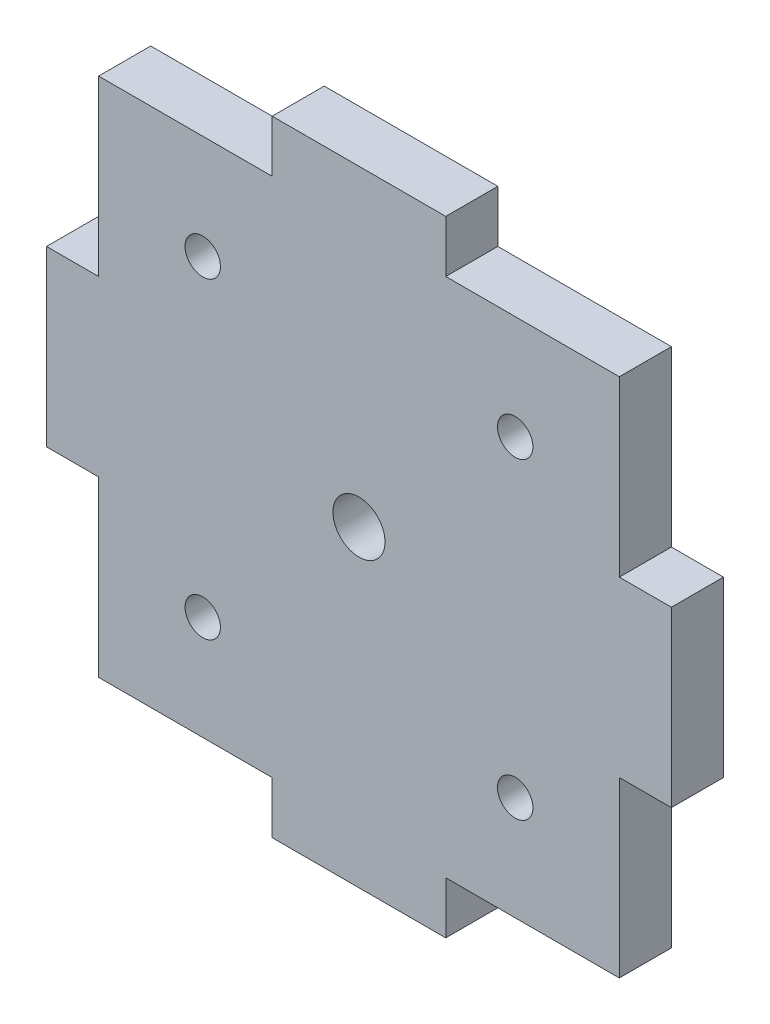
ISO-10303-21;
HEADER;
FILE_DESCRIPTION(('STEP AP214'),'2;1');
FILE_NAME('part.step','',(''),(''),'','','');
FILE_SCHEMA(('AUTOMOTIVE_DESIGN { 1 0 10303 214 1 1 1 1 }'));
ENDSEC;
DATA;
#1=APPLICATION_CONTEXT('core data for automotive mechanical design processes');
#2=APPLICATION_PROTOCOL_DEFINITION('international standard','automotive_design',2000,#1);
#3=PRODUCT_CONTEXT('',#1,'mechanical');
#4=PRODUCT('Part','Part','',(#3));
#5=PRODUCT_RELATED_PRODUCT_CATEGORY('part','',(#4));
#6=PRODUCT_DEFINITION_FORMATION('','',#4);
#7=PRODUCT_DEFINITION_CONTEXT('part definition',#1,'design');
#8=PRODUCT_DEFINITION('design','',#6,#7);
#9=PRODUCT_DEFINITION_SHAPE('','',#8);
#10=(LENGTH_UNIT() NAMED_UNIT(*) SI_UNIT(.MILLI.,.METRE.));
#11=(NAMED_UNIT(*) PLANE_ANGLE_UNIT() SI_UNIT($,.RADIAN.));
#12=(NAMED_UNIT(*) SI_UNIT($,.STERADIAN.) SOLID_ANGLE_UNIT());
#13=UNCERTAINTY_MEASURE_WITH_UNIT(LENGTH_MEASURE(1.E-05),#10,'distance_accuracy_value','');
#14=(GEOMETRIC_REPRESENTATION_CONTEXT(3) GLOBAL_UNCERTAINTY_ASSIGNED_CONTEXT((#13)) GLOBAL_UNIT_ASSIGNED_CONTEXT((#10,
#11,#12)) REPRESENTATION_CONTEXT('',''));
#15=CARTESIAN_POINT('',(0.,0.,0.));
#16=DIRECTION('',(0.,0.,1.));
#17=DIRECTION('',(1.,0.,0.));
#18=AXIS2_PLACEMENT_3D('',#15,#16,#17);
#19=CARTESIAN_POINT('',(27.25,25.,5.));
#20=DIRECTION('',(0.,0.,-1.));
#21=DIRECTION('',(-1.,0.,0.));
#22=AXIS2_PLACEMENT_3D('',#19,#20,#21);
#23=PLANE('',#22);
#24=CARTESIAN_POINT('',(17.25,15.,5.));
#25=DIRECTION('',(0.,0.,-1.));
#26=DIRECTION('',(1.,0.,0.));
#27=AXIS2_PLACEMENT_3D('',#24,#25,#26);
#28=CIRCLE('',#27,1.7);
#29=CARTESIAN_POINT('',(18.95,15.,5.));
#30=VERTEX_POINT('',#29);
#31=EDGE_CURVE('E412',#30,#30,#28,.T.);
#32=ORIENTED_EDGE('',*,*,#31,.T.);
#33=EDGE_LOOP('',(#32));
#34=FACE_BOUND('',#33,.T.);
#35=CARTESIAN_POINT('',(-12.75,15.,5.));
#36=DIRECTION('',(0.,0.,-1.));
#37=DIRECTION('',(-1.,0.,0.));
#38=AXIS2_PLACEMENT_3D('',#35,#36,#37);
#39=CIRCLE('',#38,1.7);
#40=CARTESIAN_POINT('',(-14.45,15.,5.));
#41=VERTEX_POINT('',#40);
#42=EDGE_CURVE('E393',#41,#41,#39,.T.);
#43=ORIENTED_EDGE('',*,*,#42,.T.);
#44=EDGE_LOOP('',(#43));
#45=FACE_BOUND('',#44,.T.);
#46=CARTESIAN_POINT('',(2.25,0.,5.));
#47=DIRECTION('',(0.,0.,-1.));
#48=DIRECTION('',(-1.,0.,0.));
#49=AXIS2_PLACEMENT_3D('',#46,#47,#48);
#50=CIRCLE('',#49,2.5);
#51=CARTESIAN_POINT('',(-0.249999999999998,0.,5.));
#52=VERTEX_POINT('',#51);
#53=EDGE_CURVE('E417',#52,#52,#50,.T.);
#54=ORIENTED_EDGE('',*,*,#53,.T.);
#55=EDGE_LOOP('',(#54));
#56=FACE_BOUND('',#55,.T.);
#57=CARTESIAN_POINT('',(17.25,-15.,5.));
#58=DIRECTION('',(0.,0.,-1.));
#59=DIRECTION('',(-1.,0.,0.));
#60=AXIS2_PLACEMENT_3D('',#57,#58,#59);
#61=CIRCLE('',#60,1.7);
#62=CARTESIAN_POINT('',(15.55,-15.,5.));
#63=VERTEX_POINT('',#62);
#64=EDGE_CURVE('E394',#63,#63,#61,.T.);
#65=ORIENTED_EDGE('',*,*,#64,.T.);
#66=EDGE_LOOP('',(#65));
#67=FACE_BOUND('',#66,.T.);
#68=CARTESIAN_POINT('',(-12.75,-15.,5.));
#69=DIRECTION('',(0.,0.,-1.));
#70=DIRECTION('',(-1.,0.,0.));
#71=AXIS2_PLACEMENT_3D('',#68,#69,#70);
#72=CIRCLE('',#71,1.7);
#73=CARTESIAN_POINT('',(-14.45,-15.,5.));
#74=VERTEX_POINT('',#73);
#75=EDGE_CURVE('E403',#74,#74,#72,.T.);
#76=ORIENTED_EDGE('',*,*,#75,.T.);
#77=EDGE_LOOP('',(#76));
#78=FACE_BOUND('',#77,.T.);
#79=DIRECTION('',(0.,1.,0.));
#80=VECTOR('',#79,1.);
#81=CARTESIAN_POINT('',(27.25,8.33333333333334,5.));
#82=LINE('',#81,#80);
#83=CARTESIAN_POINT('',(27.25,8.33333333333334,5.));
#84=VERTEX_POINT('',#83);
#85=CARTESIAN_POINT('',(27.25,25.,5.));
#86=VERTEX_POINT('',#85);
#87=EDGE_CURVE('E238',#84,#86,#82,.T.);
#88=ORIENTED_EDGE('',*,*,#87,.T.);
#89=DIRECTION('',(-1.,0.,0.));
#90=VECTOR('',#89,1.);
#91=CARTESIAN_POINT('',(10.5833333333333,25.,5.));
#92=LINE('',#91,#90);
#93=CARTESIAN_POINT('',(10.5833333333333,25.,5.));
#94=VERTEX_POINT('',#93);
#95=EDGE_CURVE('E128',#86,#94,#92,.T.);
#96=ORIENTED_EDGE('',*,*,#95,.T.);
#97=DIRECTION('',(0.,1.,0.));
#98=VECTOR('',#97,1.);
#99=CARTESIAN_POINT('',(10.5833333333333,25.,5.));
#100=LINE('',#99,#98);
#101=CARTESIAN_POINT('',(10.5833333333333,30.,5.));
#102=VERTEX_POINT('',#101);
#103=EDGE_CURVE('E290',#94,#102,#100,.T.);
#104=ORIENTED_EDGE('',*,*,#103,.T.);
#105=DIRECTION('',(-1.,0.,0.));
#106=VECTOR('',#105,1.);
#107=CARTESIAN_POINT('',(-6.08333333333335,30.,5.));
#108=LINE('',#107,#106);
#109=CARTESIAN_POINT('',(-6.08333333333335,30.,5.));
#110=VERTEX_POINT('',#109);
#111=EDGE_CURVE('E309',#102,#110,#108,.T.);
#112=ORIENTED_EDGE('',*,*,#111,.T.);
#113=DIRECTION('',(0.,-1.,0.));
#114=VECTOR('',#113,1.);
#115=CARTESIAN_POINT('',(-6.08333333333335,25.,5.));
#116=LINE('',#115,#114);
#117=CARTESIAN_POINT('',(-6.08333333333335,25.,5.));
#118=VERTEX_POINT('',#117);
#119=EDGE_CURVE('E306',#110,#118,#116,.T.);
#120=ORIENTED_EDGE('',*,*,#119,.T.);
#121=DIRECTION('',(-1.,0.,0.));
#122=VECTOR('',#121,1.);
#123=CARTESIAN_POINT('',(-22.75,25.,5.));
#124=LINE('',#123,#122);
#125=CARTESIAN_POINT('',(-22.75,25.,5.));
#126=VERTEX_POINT('',#125);
#127=EDGE_CURVE('E308',#118,#126,#124,.T.);
#128=ORIENTED_EDGE('',*,*,#127,.T.);
#129=DIRECTION('',(0.,-1.,0.));
#130=VECTOR('',#129,1.);
#131=CARTESIAN_POINT('',(-22.75,8.33333333333334,5.));
#132=LINE('',#131,#130);
#133=CARTESIAN_POINT('',(-22.75,8.33333333333334,5.));
#134=VERTEX_POINT('',#133);
#135=EDGE_CURVE('E311',#126,#134,#132,.T.);
#136=ORIENTED_EDGE('',*,*,#135,.T.);
#137=DIRECTION('',(-1.,0.,0.));
#138=VECTOR('',#137,1.);
#139=CARTESIAN_POINT('',(-22.75,8.33333333333334,5.));
#140=LINE('',#139,#138);
#141=CARTESIAN_POINT('',(-27.75,8.33333333333333,5.));
#142=VERTEX_POINT('',#141);
#143=EDGE_CURVE('E317',#134,#142,#140,.T.);
#144=ORIENTED_EDGE('',*,*,#143,.T.);
#145=DIRECTION('',(0.,-1.,0.));
#146=VECTOR('',#145,1.);
#147=CARTESIAN_POINT('',(-27.75,-8.33333333333333,5.));
#148=LINE('',#147,#146);
#149=CARTESIAN_POINT('',(-27.75,-8.33333333333333,5.));
#150=VERTEX_POINT('',#149);
#151=EDGE_CURVE('E319',#142,#150,#148,.T.);
#152=ORIENTED_EDGE('',*,*,#151,.T.);
#153=DIRECTION('',(1.,0.,0.));
#154=VECTOR('',#153,1.);
#155=CARTESIAN_POINT('',(-22.75,-8.33333333333334,5.));
#156=LINE('',#155,#154);
#157=CARTESIAN_POINT('',(-22.75,-8.33333333333334,5.));
#158=VERTEX_POINT('',#157);
#159=EDGE_CURVE('E321',#150,#158,#156,.T.);
#160=ORIENTED_EDGE('',*,*,#159,.T.);
#161=DIRECTION('',(0.,-1.,0.));
#162=VECTOR('',#161,1.);
#163=CARTESIAN_POINT('',(-22.75,-25.,5.));
#164=LINE('',#163,#162);
#165=CARTESIAN_POINT('',(-22.75,-25.,5.));
#166=VERTEX_POINT('',#165);
#167=EDGE_CURVE('E323',#158,#166,#164,.T.);
#168=ORIENTED_EDGE('',*,*,#167,.T.);
#169=DIRECTION('',(1.,0.,0.));
#170=VECTOR('',#169,1.);
#171=CARTESIAN_POINT('',(-22.75,-25.,5.));
#172=LINE('',#171,#170);
#173=CARTESIAN_POINT('',(-6.08333333333335,-25.,5.));
#174=VERTEX_POINT('',#173);
#175=EDGE_CURVE('E325',#166,#174,#172,.T.);
#176=ORIENTED_EDGE('',*,*,#175,.T.);
#177=DIRECTION('',(0.,-1.,0.));
#178=VECTOR('',#177,1.);
#179=CARTESIAN_POINT('',(-6.08333333333335,-25.,5.));
#180=LINE('',#179,#178);
#181=CARTESIAN_POINT('',(-6.08333333333335,-30.,5.));
#182=VERTEX_POINT('',#181);
#183=EDGE_CURVE('E327',#174,#182,#180,.T.);
#184=ORIENTED_EDGE('',*,*,#183,.T.);
#185=DIRECTION('',(1.,0.,0.));
#186=VECTOR('',#185,1.);
#187=CARTESIAN_POINT('',(10.5833333333333,-30.,5.));
#188=LINE('',#187,#186);
#189=CARTESIAN_POINT('',(10.5833333333333,-30.,5.));
#190=VERTEX_POINT('',#189);
#191=EDGE_CURVE('E329',#182,#190,#188,.T.);
#192=ORIENTED_EDGE('',*,*,#191,.T.);
#193=DIRECTION('',(0.,1.,0.));
#194=VECTOR('',#193,1.);
#195=CARTESIAN_POINT('',(10.5833333333333,-25.,5.));
#196=LINE('',#195,#194);
#197=CARTESIAN_POINT('',(10.5833333333333,-25.,5.));
#198=VERTEX_POINT('',#197);
#199=EDGE_CURVE('E331',#190,#198,#196,.T.);
#200=ORIENTED_EDGE('',*,*,#199,.T.);
#201=DIRECTION('',(1.,0.,0.));
#202=VECTOR('',#201,1.);
#203=CARTESIAN_POINT('',(10.5833333333333,-25.,5.));
#204=LINE('',#203,#202);
#205=CARTESIAN_POINT('',(27.25,-25.,5.));
#206=VERTEX_POINT('',#205);
#207=EDGE_CURVE('E333',#198,#206,#204,.T.);
#208=ORIENTED_EDGE('',*,*,#207,.T.);
#209=DIRECTION('',(0.,1.,0.));
#210=VECTOR('',#209,1.);
#211=CARTESIAN_POINT('',(27.25,-25.,5.));
#212=LINE('',#211,#210);
#213=CARTESIAN_POINT('',(27.25,-8.33333333333333,5.));
#214=VERTEX_POINT('',#213);
#215=EDGE_CURVE('E182',#206,#214,#212,.T.);
#216=ORIENTED_EDGE('',*,*,#215,.T.);
#217=DIRECTION('',(1.,0.,0.));
#218=VECTOR('',#217,1.);
#219=CARTESIAN_POINT('',(27.25,-8.33333333333333,5.));
#220=LINE('',#219,#218);
#221=CARTESIAN_POINT('',(32.25,-8.33333333333333,5.));
#222=VERTEX_POINT('',#221);
#223=EDGE_CURVE('E177',#214,#222,#220,.T.);
#224=ORIENTED_EDGE('',*,*,#223,.T.);
#225=DIRECTION('',(0.,1.,0.));
#226=VECTOR('',#225,1.);
#227=CARTESIAN_POINT('',(32.25,8.33333333333334,5.));
#228=LINE('',#227,#226);
#229=CARTESIAN_POINT('',(32.25,8.33333333333334,5.));
#230=VERTEX_POINT('',#229);
#231=EDGE_CURVE('E180',#222,#230,#228,.T.);
#232=ORIENTED_EDGE('',*,*,#231,.T.);
#233=DIRECTION('',(-1.,0.,0.));
#234=VECTOR('',#233,1.);
#235=CARTESIAN_POINT('',(27.25,8.33333333333334,5.));
#236=LINE('',#235,#234);
#237=EDGE_CURVE('E49',#230,#84,#236,.T.);
#238=ORIENTED_EDGE('',*,*,#237,.T.);
#239=EDGE_LOOP('',(#88,#96,#104,#112,#120,#128,#136,#144,#152,#160,#168,#176,#184,#192,#200,
#208,#216,#224,#232,#238));
#240=FACE_BOUND('',#239,.T.);
#241=ADVANCED_FACE('F31',(#34,#45,#56,#67,#78,#240),#23,.F.);
#242=CARTESIAN_POINT('',(27.25,25.,0.));
#243=DIRECTION('',(0.,0.,-1.));
#244=DIRECTION('',(-1.,0.,0.));
#245=AXIS2_PLACEMENT_3D('',#242,#243,#244);
#246=PLANE('',#245);
#247=CARTESIAN_POINT('',(17.25,15.,0.));
#248=DIRECTION('',(0.,0.,-1.));
#249=DIRECTION('',(1.,0.,0.));
#250=AXIS2_PLACEMENT_3D('',#247,#248,#249);
#251=CIRCLE('',#250,1.7);
#252=CARTESIAN_POINT('',(18.95,15.,0.));
#253=VERTEX_POINT('',#252);
#254=EDGE_CURVE('E411',#253,#253,#251,.T.);
#255=ORIENTED_EDGE('',*,*,#254,.F.);
#256=EDGE_LOOP('',(#255));
#257=FACE_BOUND('',#256,.T.);
#258=CARTESIAN_POINT('',(-12.75,15.,0.));
#259=DIRECTION('',(0.,0.,1.));
#260=DIRECTION('',(-1.,0.,0.));
#261=AXIS2_PLACEMENT_3D('',#258,#259,#260);
#262=CIRCLE('',#261,1.7);
#263=CARTESIAN_POINT('',(-14.45,15.,0.));
#264=VERTEX_POINT('',#263);
#265=EDGE_CURVE('E390',#264,#264,#262,.T.);
#266=ORIENTED_EDGE('',*,*,#265,.T.);
#267=EDGE_LOOP('',(#266));
#268=FACE_BOUND('',#267,.T.);
#269=DIRECTION('',(0.,1.,0.));
#270=VECTOR('',#269,1.);
#271=CARTESIAN_POINT('',(27.25,8.33333333333334,0.));
#272=LINE('',#271,#270);
#273=CARTESIAN_POINT('',(27.25,8.33333333333334,0.));
#274=VERTEX_POINT('',#273);
#275=CARTESIAN_POINT('',(27.25,25.,0.));
#276=VERTEX_POINT('',#275);
#277=EDGE_CURVE('E200',#274,#276,#272,.T.);
#278=ORIENTED_EDGE('',*,*,#277,.F.);
#279=DIRECTION('',(-1.,0.,0.));
#280=VECTOR('',#279,1.);
#281=CARTESIAN_POINT('',(27.25,8.33333333333334,0.));
#282=LINE('',#281,#280);
#283=CARTESIAN_POINT('',(32.25,8.33333333333334,0.));
#284=VERTEX_POINT('',#283);
#285=EDGE_CURVE('E120',#284,#274,#282,.T.);
#286=ORIENTED_EDGE('',*,*,#285,.F.);
#287=DIRECTION('',(0.,1.,0.));
#288=VECTOR('',#287,1.);
#289=CARTESIAN_POINT('',(32.25,8.33333333333334,0.));
#290=LINE('',#289,#288);
#291=CARTESIAN_POINT('',(32.25,-8.33333333333333,0.));
#292=VERTEX_POINT('',#291);
#293=EDGE_CURVE('E114',#292,#284,#290,.T.);
#294=ORIENTED_EDGE('',*,*,#293,.F.);
#295=DIRECTION('',(1.,0.,0.));
#296=VECTOR('',#295,1.);
#297=CARTESIAN_POINT('',(27.25,-8.33333333333333,0.));
#298=LINE('',#297,#296);
#299=CARTESIAN_POINT('',(27.25,-8.33333333333333,0.));
#300=VERTEX_POINT('',#299);
#301=EDGE_CURVE('E190',#300,#292,#298,.T.);
#302=ORIENTED_EDGE('',*,*,#301,.F.);
#303=DIRECTION('',(0.,1.,0.));
#304=VECTOR('',#303,1.);
#305=CARTESIAN_POINT('',(27.25,-25.,0.));
#306=LINE('',#305,#304);
#307=CARTESIAN_POINT('',(27.25,-25.,0.));
#308=VERTEX_POINT('',#307);
#309=EDGE_CURVE('E233',#308,#300,#306,.T.);
#310=ORIENTED_EDGE('',*,*,#309,.F.);
#311=DIRECTION('',(1.,0.,0.));
#312=VECTOR('',#311,1.);
#313=CARTESIAN_POINT('',(10.5833333333333,-25.,0.));
#314=LINE('',#313,#312);
#315=CARTESIAN_POINT('',(10.5833333333333,-25.,0.));
#316=VERTEX_POINT('',#315);
#317=EDGE_CURVE('E231',#316,#308,#314,.T.);
#318=ORIENTED_EDGE('',*,*,#317,.F.);
#319=DIRECTION('',(0.,1.,0.));
#320=VECTOR('',#319,1.);
#321=CARTESIAN_POINT('',(10.5833333333333,-25.,0.));
#322=LINE('',#321,#320);
#323=CARTESIAN_POINT('',(10.5833333333333,-30.,0.));
#324=VERTEX_POINT('',#323);
#325=EDGE_CURVE('E229',#324,#316,#322,.T.);
#326=ORIENTED_EDGE('',*,*,#325,.F.);
#327=DIRECTION('',(1.,0.,0.));
#328=VECTOR('',#327,1.);
#329=CARTESIAN_POINT('',(10.5833333333333,-30.,0.));
#330=LINE('',#329,#328);
#331=CARTESIAN_POINT('',(-6.08333333333335,-30.,0.));
#332=VERTEX_POINT('',#331);
#333=EDGE_CURVE('E227',#332,#324,#330,.T.);
#334=ORIENTED_EDGE('',*,*,#333,.F.);
#335=DIRECTION('',(0.,-1.,0.));
#336=VECTOR('',#335,1.);
#337=CARTESIAN_POINT('',(-6.08333333333335,-25.,0.));
#338=LINE('',#337,#336);
#339=CARTESIAN_POINT('',(-6.08333333333335,-25.,0.));
#340=VERTEX_POINT('',#339);
#341=EDGE_CURVE('E225',#340,#332,#338,.T.);
#342=ORIENTED_EDGE('',*,*,#341,.F.);
#343=DIRECTION('',(1.,0.,0.));
#344=VECTOR('',#343,1.);
#345=CARTESIAN_POINT('',(-22.75,-25.,0.));
#346=LINE('',#345,#344);
#347=CARTESIAN_POINT('',(-22.75,-25.,0.));
#348=VERTEX_POINT('',#347);
#349=EDGE_CURVE('E223',#348,#340,#346,.T.);
#350=ORIENTED_EDGE('',*,*,#349,.F.);
#351=DIRECTION('',(0.,-1.,0.));
#352=VECTOR('',#351,1.);
#353=CARTESIAN_POINT('',(-22.75,-25.,0.));
#354=LINE('',#353,#352);
#355=CARTESIAN_POINT('',(-22.75,-8.33333333333334,0.));
#356=VERTEX_POINT('',#355);
#357=EDGE_CURVE('E221',#356,#348,#354,.T.);
#358=ORIENTED_EDGE('',*,*,#357,.F.);
#359=DIRECTION('',(1.,0.,0.));
#360=VECTOR('',#359,1.);
#361=CARTESIAN_POINT('',(-22.75,-8.33333333333334,0.));
#362=LINE('',#361,#360);
#363=CARTESIAN_POINT('',(-27.75,-8.33333333333333,0.));
#364=VERTEX_POINT('',#363);
#365=EDGE_CURVE('E219',#364,#356,#362,.T.);
#366=ORIENTED_EDGE('',*,*,#365,.F.);
#367=DIRECTION('',(0.,-1.,0.));
#368=VECTOR('',#367,1.);
#369=CARTESIAN_POINT('',(-27.75,-8.33333333333333,0.));
#370=LINE('',#369,#368);
#371=CARTESIAN_POINT('',(-27.75,8.33333333333333,0.));
#372=VERTEX_POINT('',#371);
#373=EDGE_CURVE('E217',#372,#364,#370,.T.);
#374=ORIENTED_EDGE('',*,*,#373,.F.);
#375=DIRECTION('',(-1.,0.,0.));
#376=VECTOR('',#375,1.);
#377=CARTESIAN_POINT('',(-22.75,8.33333333333334,0.));
#378=LINE('',#377,#376);
#379=CARTESIAN_POINT('',(-22.75,8.33333333333334,0.));
#380=VERTEX_POINT('',#379);
#381=EDGE_CURVE('E215',#380,#372,#378,.T.);
#382=ORIENTED_EDGE('',*,*,#381,.F.);
#383=DIRECTION('',(0.,-1.,0.));
#384=VECTOR('',#383,1.);
#385=CARTESIAN_POINT('',(-22.75,8.33333333333334,0.));
#386=LINE('',#385,#384);
#387=CARTESIAN_POINT('',(-22.75,25.,0.));
#388=VERTEX_POINT('',#387);
#389=EDGE_CURVE('E213',#388,#380,#386,.T.);
#390=ORIENTED_EDGE('',*,*,#389,.F.);
#391=DIRECTION('',(-1.,0.,0.));
#392=VECTOR('',#391,1.);
#393=CARTESIAN_POINT('',(-22.75,25.,0.));
#394=LINE('',#393,#392);
#395=CARTESIAN_POINT('',(-6.08333333333335,25.,0.));
#396=VERTEX_POINT('',#395);
#397=EDGE_CURVE('E211',#396,#388,#394,.T.);
#398=ORIENTED_EDGE('',*,*,#397,.F.);
#399=DIRECTION('',(0.,-1.,0.));
#400=VECTOR('',#399,1.);
#401=CARTESIAN_POINT('',(-6.08333333333335,25.,0.));
#402=LINE('',#401,#400);
#403=CARTESIAN_POINT('',(-6.08333333333335,30.,0.));
#404=VERTEX_POINT('',#403);
#405=EDGE_CURVE('E209',#404,#396,#402,.T.);
#406=ORIENTED_EDGE('',*,*,#405,.F.);
#407=DIRECTION('',(-1.,0.,0.));
#408=VECTOR('',#407,1.);
#409=CARTESIAN_POINT('',(-6.08333333333335,30.,0.));
#410=LINE('',#409,#408);
#411=CARTESIAN_POINT('',(10.5833333333333,30.,0.));
#412=VERTEX_POINT('',#411);
#413=EDGE_CURVE('E207',#412,#404,#410,.T.);
#414=ORIENTED_EDGE('',*,*,#413,.F.);
#415=DIRECTION('',(0.,1.,0.));
#416=VECTOR('',#415,1.);
#417=CARTESIAN_POINT('',(10.5833333333333,25.,0.));
#418=LINE('',#417,#416);
#419=CARTESIAN_POINT('',(10.5833333333333,25.,0.));
#420=VERTEX_POINT('',#419);
#421=EDGE_CURVE('E205',#420,#412,#418,.T.);
#422=ORIENTED_EDGE('',*,*,#421,.F.);
#423=DIRECTION('',(-1.,0.,0.));
#424=VECTOR('',#423,1.);
#425=CARTESIAN_POINT('',(10.5833333333333,25.,0.));
#426=LINE('',#425,#424);
#427=EDGE_CURVE('E203',#276,#420,#426,.T.);
#428=ORIENTED_EDGE('',*,*,#427,.F.);
#429=EDGE_LOOP('',(#278,#286,#294,#302,#310,#318,#326,#334,#342,#350,#358,#366,#374,#382,#390,
#398,#406,#414,#422,#428));
#430=FACE_BOUND('',#429,.T.);
#431=CARTESIAN_POINT('',(2.25,0.,0.));
#432=DIRECTION('',(0.,0.,-1.));
#433=DIRECTION('',(-1.,0.,0.));
#434=AXIS2_PLACEMENT_3D('',#431,#432,#433);
#435=CIRCLE('',#434,2.5);
#436=CARTESIAN_POINT('',(-0.249999999999998,0.,0.));
#437=VERTEX_POINT('',#436);
#438=EDGE_CURVE('E35',#437,#437,#435,.F.);
#439=ORIENTED_EDGE('',*,*,#438,.T.);
#440=EDGE_LOOP('',(#439));
#441=FACE_BOUND('',#440,.T.);
#442=CARTESIAN_POINT('',(17.25,-15.,0.));
#443=DIRECTION('',(0.,0.,1.));
#444=DIRECTION('',(1.,0.,0.));
#445=AXIS2_PLACEMENT_3D('',#442,#443,#444);
#446=CIRCLE('',#445,1.7);
#447=CARTESIAN_POINT('',(18.95,-15.,0.));
#448=VERTEX_POINT('',#447);
#449=EDGE_CURVE('E406',#448,#448,#446,.T.);
#450=ORIENTED_EDGE('',*,*,#449,.T.);
#451=EDGE_LOOP('',(#450));
#452=FACE_BOUND('',#451,.T.);
#453=CARTESIAN_POINT('',(-12.75,-15.,0.));
#454=DIRECTION('',(0.,0.,-1.));
#455=DIRECTION('',(-1.,0.,0.));
#456=AXIS2_PLACEMENT_3D('',#453,#454,#455);
#457=CIRCLE('',#456,1.7);
#458=CARTESIAN_POINT('',(-14.45,-15.,0.));
#459=VERTEX_POINT('',#458);
#460=EDGE_CURVE('E398',#459,#459,#457,.T.);
#461=ORIENTED_EDGE('',*,*,#460,.F.);
#462=EDGE_LOOP('',(#461));
#463=FACE_BOUND('',#462,.T.);
#464=ADVANCED_FACE('F294',(#257,#268,#430,#441,#452,#463),#246,.T.);
#465=CARTESIAN_POINT('',(27.25,8.33333333333334,5.));
#466=DIRECTION('',(-1.,0.,0.));
#467=DIRECTION('',(0.,0.,1.));
#468=AXIS2_PLACEMENT_3D('',#465,#466,#467);
#469=PLANE('',#468);
#470=ORIENTED_EDGE('',*,*,#277,.T.);
#471=DIRECTION('',(0.,0.,-1.));
#472=VECTOR('',#471,1.);
#473=CARTESIAN_POINT('',(27.25,25.,5.));
#474=LINE('',#473,#472);
#475=EDGE_CURVE('E11',#86,#276,#474,.T.);
#476=ORIENTED_EDGE('',*,*,#475,.F.);
#477=ORIENTED_EDGE('',*,*,#87,.F.);
#478=DIRECTION('',(0.,0.,-1.));
#479=VECTOR('',#478,1.);
#480=CARTESIAN_POINT('',(27.25,8.33333333333334,5.));
#481=LINE('',#480,#479);
#482=EDGE_CURVE('E196',#84,#274,#481,.T.);
#483=ORIENTED_EDGE('',*,*,#482,.T.);
#484=EDGE_LOOP('',(#470,#476,#477,#483));
#485=FACE_BOUND('',#484,.T.);
#486=ADVANCED_FACE('F33',(#485),#469,.F.);
#487=CARTESIAN_POINT('',(10.5833333333333,25.,5.));
#488=DIRECTION('',(0.,-1.,0.));
#489=DIRECTION('',(1.,0.,0.));
#490=AXIS2_PLACEMENT_3D('',#487,#488,#489);
#491=PLANE('',#490);
#492=ORIENTED_EDGE('',*,*,#427,.T.);
#493=DIRECTION('',(0.,0.,-1.));
#494=VECTOR('',#493,1.);
#495=CARTESIAN_POINT('',(10.5833333333333,25.,5.));
#496=LINE('',#495,#494);
#497=EDGE_CURVE('E41',#94,#420,#496,.T.);
#498=ORIENTED_EDGE('',*,*,#497,.F.);
#499=ORIENTED_EDGE('',*,*,#95,.F.);
#500=ORIENTED_EDGE('',*,*,#475,.T.);
#501=EDGE_LOOP('',(#492,#498,#499,#500));
#502=FACE_BOUND('',#501,.T.);
#503=ADVANCED_FACE('F613',(#502),#491,.F.);
#504=CARTESIAN_POINT('',(10.5833333333333,25.,5.));
#505=DIRECTION('',(-1.,0.,0.));
#506=DIRECTION('',(0.,-1.,0.));
#507=AXIS2_PLACEMENT_3D('',#504,#505,#506);
#508=PLANE('',#507);
#509=ORIENTED_EDGE('',*,*,#421,.T.);
#510=DIRECTION('',(0.,0.,-1.));
#511=VECTOR('',#510,1.);
#512=CARTESIAN_POINT('',(10.5833333333333,30.,5.));
#513=LINE('',#512,#511);
#514=EDGE_CURVE('E281',#102,#412,#513,.T.);
#515=ORIENTED_EDGE('',*,*,#514,.F.);
#516=ORIENTED_EDGE('',*,*,#103,.F.);
#517=ORIENTED_EDGE('',*,*,#497,.T.);
#518=EDGE_LOOP('',(#509,#515,#516,#517));
#519=FACE_BOUND('',#518,.T.);
#520=ADVANCED_FACE('F288',(#519),#508,.F.);
#521=CARTESIAN_POINT('',(-6.08333333333335,30.,5.));
#522=DIRECTION('',(0.,-1.,0.));
#523=DIRECTION('',(1.,0.,0.));
#524=AXIS2_PLACEMENT_3D('',#521,#522,#523);
#525=PLANE('',#524);
#526=ORIENTED_EDGE('',*,*,#413,.T.);
#527=DIRECTION('',(0.,0.,-1.));
#528=VECTOR('',#527,1.);
#529=CARTESIAN_POINT('',(-6.08333333333335,30.,5.));
#530=LINE('',#529,#528);
#531=EDGE_CURVE('E278',#110,#404,#530,.T.);
#532=ORIENTED_EDGE('',*,*,#531,.F.);
#533=ORIENTED_EDGE('',*,*,#111,.F.);
#534=ORIENTED_EDGE('',*,*,#514,.T.);
#535=EDGE_LOOP('',(#526,#532,#533,#534));
#536=FACE_BOUND('',#535,.T.);
#537=ADVANCED_FACE('F300',(#536),#525,.F.);
#538=CARTESIAN_POINT('',(-6.08333333333335,25.,5.));
#539=DIRECTION('',(1.,0.,0.));
#540=DIRECTION('',(0.,1.,0.));
#541=AXIS2_PLACEMENT_3D('',#538,#539,#540);
#542=PLANE('',#541);
#543=ORIENTED_EDGE('',*,*,#405,.T.);
#544=DIRECTION('',(0.,0.,-1.));
#545=VECTOR('',#544,1.);
#546=CARTESIAN_POINT('',(-6.08333333333335,25.,5.));
#547=LINE('',#546,#545);
#548=EDGE_CURVE('E275',#118,#396,#547,.T.);
#549=ORIENTED_EDGE('',*,*,#548,.F.);
#550=ORIENTED_EDGE('',*,*,#119,.F.);
#551=ORIENTED_EDGE('',*,*,#531,.T.);
#552=EDGE_LOOP('',(#543,#549,#550,#551));
#553=FACE_BOUND('',#552,.T.);
#554=ADVANCED_FACE('F304',(#553),#542,.F.);
#555=CARTESIAN_POINT('',(-22.75,25.,5.));
#556=DIRECTION('',(0.,-1.,0.));
#557=DIRECTION('',(1.,0.,0.));
#558=AXIS2_PLACEMENT_3D('',#555,#556,#557);
#559=PLANE('',#558);
#560=ORIENTED_EDGE('',*,*,#397,.T.);
#561=DIRECTION('',(0.,0.,-1.));
#562=VECTOR('',#561,1.);
#563=CARTESIAN_POINT('',(-22.75,25.,5.));
#564=LINE('',#563,#562);
#565=EDGE_CURVE('E272',#126,#388,#564,.T.);
#566=ORIENTED_EDGE('',*,*,#565,.F.);
#567=ORIENTED_EDGE('',*,*,#127,.F.);
#568=ORIENTED_EDGE('',*,*,#548,.T.);
#569=EDGE_LOOP('',(#560,#566,#567,#568));
#570=FACE_BOUND('',#569,.T.);
#571=ADVANCED_FACE('F582',(#570),#559,.F.);
#572=CARTESIAN_POINT('',(-22.75,8.33333333333334,5.));
#573=DIRECTION('',(1.,0.,0.));
#574=DIRECTION('',(0.,0.,-1.));
#575=AXIS2_PLACEMENT_3D('',#572,#573,#574);
#576=PLANE('',#575);
#577=ORIENTED_EDGE('',*,*,#389,.T.);
#578=DIRECTION('',(0.,0.,-1.));
#579=VECTOR('',#578,1.);
#580=CARTESIAN_POINT('',(-22.75,8.33333333333334,5.));
#581=LINE('',#580,#579);
#582=EDGE_CURVE('E269',#134,#380,#581,.T.);
#583=ORIENTED_EDGE('',*,*,#582,.F.);
#584=ORIENTED_EDGE('',*,*,#135,.F.);
#585=ORIENTED_EDGE('',*,*,#565,.T.);
#586=EDGE_LOOP('',(#577,#583,#584,#585));
#587=FACE_BOUND('',#586,.T.);
#588=ADVANCED_FACE('F573',(#587),#576,.F.);
#589=CARTESIAN_POINT('',(-22.75,8.33333333333334,5.));
#590=DIRECTION('',(0.,-1.,0.));
#591=DIRECTION('',(1.,0.,0.));
#592=AXIS2_PLACEMENT_3D('',#589,#590,#591);
#593=PLANE('',#592);
#594=ORIENTED_EDGE('',*,*,#381,.T.);
#595=DIRECTION('',(0.,0.,-1.));
#596=VECTOR('',#595,1.);
#597=CARTESIAN_POINT('',(-27.75,8.33333333333333,5.));
#598=LINE('',#597,#596);
#599=EDGE_CURVE('E266',#142,#372,#598,.T.);
#600=ORIENTED_EDGE('',*,*,#599,.F.);
#601=ORIENTED_EDGE('',*,*,#143,.F.);
#602=ORIENTED_EDGE('',*,*,#582,.T.);
#603=EDGE_LOOP('',(#594,#600,#601,#602));
#604=FACE_BOUND('',#603,.T.);
#605=ADVANCED_FACE('F564',(#604),#593,.F.);
#606=CARTESIAN_POINT('',(-27.75,-8.33333333333333,5.));
#607=DIRECTION('',(1.,0.,0.));
#608=DIRECTION('',(0.,1.,0.));
#609=AXIS2_PLACEMENT_3D('',#606,#607,#608);
#610=PLANE('',#609);
#611=ORIENTED_EDGE('',*,*,#373,.T.);
#612=DIRECTION('',(0.,0.,-1.));
#613=VECTOR('',#612,1.);
#614=CARTESIAN_POINT('',(-27.75,-8.33333333333333,5.));
#615=LINE('',#614,#613);
#616=EDGE_CURVE('E263',#150,#364,#615,.T.);
#617=ORIENTED_EDGE('',*,*,#616,.F.);
#618=ORIENTED_EDGE('',*,*,#151,.F.);
#619=ORIENTED_EDGE('',*,*,#599,.T.);
#620=EDGE_LOOP('',(#611,#617,#618,#619));
#621=FACE_BOUND('',#620,.T.);
#622=ADVANCED_FACE('F555',(#621),#610,.F.);
#623=CARTESIAN_POINT('',(-22.75,-8.33333333333334,5.));
#624=DIRECTION('',(0.,1.,0.));
#625=DIRECTION('',(-1.,0.,0.));
#626=AXIS2_PLACEMENT_3D('',#623,#624,#625);
#627=PLANE('',#626);
#628=ORIENTED_EDGE('',*,*,#365,.T.);
#629=DIRECTION('',(0.,0.,-1.));
#630=VECTOR('',#629,1.);
#631=CARTESIAN_POINT('',(-22.75,-8.33333333333334,5.));
#632=LINE('',#631,#630);
#633=EDGE_CURVE('E260',#158,#356,#632,.T.);
#634=ORIENTED_EDGE('',*,*,#633,.F.);
#635=ORIENTED_EDGE('',*,*,#159,.F.);
#636=ORIENTED_EDGE('',*,*,#616,.T.);
#637=EDGE_LOOP('',(#628,#634,#635,#636));
#638=FACE_BOUND('',#637,.T.);
#639=ADVANCED_FACE('F546',(#638),#627,.F.);
#640=CARTESIAN_POINT('',(-22.75,-25.,5.));
#641=DIRECTION('',(1.,0.,0.));
#642=DIRECTION('',(0.,0.,-1.));
#643=AXIS2_PLACEMENT_3D('',#640,#641,#642);
#644=PLANE('',#643);
#645=ORIENTED_EDGE('',*,*,#357,.T.);
#646=DIRECTION('',(0.,0.,-1.));
#647=VECTOR('',#646,1.);
#648=CARTESIAN_POINT('',(-22.75,-25.,5.));
#649=LINE('',#648,#647);
#650=EDGE_CURVE('E257',#166,#348,#649,.T.);
#651=ORIENTED_EDGE('',*,*,#650,.F.);
#652=ORIENTED_EDGE('',*,*,#167,.F.);
#653=ORIENTED_EDGE('',*,*,#633,.T.);
#654=EDGE_LOOP('',(#645,#651,#652,#653));
#655=FACE_BOUND('',#654,.T.);
#656=ADVANCED_FACE('F537',(#655),#644,.F.);
#657=CARTESIAN_POINT('',(-22.75,-25.,5.));
#658=DIRECTION('',(0.,1.,0.));
#659=DIRECTION('',(0.,0.,1.));
#660=AXIS2_PLACEMENT_3D('',#657,#658,#659);
#661=PLANE('',#660);
#662=ORIENTED_EDGE('',*,*,#349,.T.);
#663=DIRECTION('',(0.,0.,-1.));
#664=VECTOR('',#663,1.);
#665=CARTESIAN_POINT('',(-6.08333333333335,-25.,5.));
#666=LINE('',#665,#664);
#667=EDGE_CURVE('E254',#174,#340,#666,.T.);
#668=ORIENTED_EDGE('',*,*,#667,.F.);
#669=ORIENTED_EDGE('',*,*,#175,.F.);
#670=ORIENTED_EDGE('',*,*,#650,.T.);
#671=EDGE_LOOP('',(#662,#668,#669,#670));
#672=FACE_BOUND('',#671,.T.);
#673=ADVANCED_FACE('F528',(#672),#661,.F.);
#674=CARTESIAN_POINT('',(-6.08333333333335,-25.,5.));
#675=DIRECTION('',(1.,0.,0.));
#676=DIRECTION('',(0.,1.,0.));
#677=AXIS2_PLACEMENT_3D('',#674,#675,#676);
#678=PLANE('',#677);
#679=ORIENTED_EDGE('',*,*,#341,.T.);
#680=DIRECTION('',(0.,0.,-1.));
#681=VECTOR('',#680,1.);
#682=CARTESIAN_POINT('',(-6.08333333333335,-30.,5.));
#683=LINE('',#682,#681);
#684=EDGE_CURVE('E251',#182,#332,#683,.T.);
#685=ORIENTED_EDGE('',*,*,#684,.F.);
#686=ORIENTED_EDGE('',*,*,#183,.F.);
#687=ORIENTED_EDGE('',*,*,#667,.T.);
#688=EDGE_LOOP('',(#679,#685,#686,#687));
#689=FACE_BOUND('',#688,.T.);
#690=ADVANCED_FACE('F519',(#689),#678,.F.);
#691=CARTESIAN_POINT('',(10.5833333333333,-30.,5.));
#692=DIRECTION('',(0.,1.,0.));
#693=DIRECTION('',(-1.,0.,0.));
#694=AXIS2_PLACEMENT_3D('',#691,#692,#693);
#695=PLANE('',#694);
#696=ORIENTED_EDGE('',*,*,#333,.T.);
#697=DIRECTION('',(0.,0.,-1.));
#698=VECTOR('',#697,1.);
#699=CARTESIAN_POINT('',(10.5833333333333,-30.,5.));
#700=LINE('',#699,#698);
#701=EDGE_CURVE('E248',#190,#324,#700,.T.);
#702=ORIENTED_EDGE('',*,*,#701,.F.);
#703=ORIENTED_EDGE('',*,*,#191,.F.);
#704=ORIENTED_EDGE('',*,*,#684,.T.);
#705=EDGE_LOOP('',(#696,#702,#703,#704));
#706=FACE_BOUND('',#705,.T.);
#707=ADVANCED_FACE('F510',(#706),#695,.F.);
#708=CARTESIAN_POINT('',(10.5833333333333,-25.,5.));
#709=DIRECTION('',(-1.,0.,0.));
#710=DIRECTION('',(0.,-1.,0.));
#711=AXIS2_PLACEMENT_3D('',#708,#709,#710);
#712=PLANE('',#711);
#713=ORIENTED_EDGE('',*,*,#325,.T.);
#714=DIRECTION('',(0.,0.,-1.));
#715=VECTOR('',#714,1.);
#716=CARTESIAN_POINT('',(10.5833333333333,-25.,5.));
#717=LINE('',#716,#715);
#718=EDGE_CURVE('E245',#198,#316,#717,.T.);
#719=ORIENTED_EDGE('',*,*,#718,.F.);
#720=ORIENTED_EDGE('',*,*,#199,.F.);
#721=ORIENTED_EDGE('',*,*,#701,.T.);
#722=EDGE_LOOP('',(#713,#719,#720,#721));
#723=FACE_BOUND('',#722,.T.);
#724=ADVANCED_FACE('F502',(#723),#712,.F.);
#725=CARTESIAN_POINT('',(10.5833333333333,-25.,5.));
#726=DIRECTION('',(0.,1.,0.));
#727=DIRECTION('',(-1.,0.,0.));
#728=AXIS2_PLACEMENT_3D('',#725,#726,#727);
#729=PLANE('',#728);
#730=ORIENTED_EDGE('',*,*,#317,.T.);
#731=DIRECTION('',(0.,0.,-1.));
#732=VECTOR('',#731,1.);
#733=CARTESIAN_POINT('',(27.25,-25.,5.));
#734=LINE('',#733,#732);
#735=EDGE_CURVE('E242',#206,#308,#734,.T.);
#736=ORIENTED_EDGE('',*,*,#735,.F.);
#737=ORIENTED_EDGE('',*,*,#207,.F.);
#738=ORIENTED_EDGE('',*,*,#718,.T.);
#739=EDGE_LOOP('',(#730,#736,#737,#738));
#740=FACE_BOUND('',#739,.T.);
#741=ADVANCED_FACE('F339',(#740),#729,.F.);
#742=CARTESIAN_POINT('',(27.25,-25.,5.));
#743=DIRECTION('',(-1.,0.,0.));
#744=DIRECTION('',(0.,0.,1.));
#745=AXIS2_PLACEMENT_3D('',#742,#743,#744);
#746=PLANE('',#745);
#747=ORIENTED_EDGE('',*,*,#309,.T.);
#748=DIRECTION('',(0.,0.,-1.));
#749=VECTOR('',#748,1.);
#750=CARTESIAN_POINT('',(27.25,-8.33333333333333,5.));
#751=LINE('',#750,#749);
#752=EDGE_CURVE('E191',#214,#300,#751,.T.);
#753=ORIENTED_EDGE('',*,*,#752,.F.);
#754=ORIENTED_EDGE('',*,*,#215,.F.);
#755=ORIENTED_EDGE('',*,*,#735,.T.);
#756=EDGE_LOOP('',(#747,#753,#754,#755));
#757=FACE_BOUND('',#756,.T.);
#758=ADVANCED_FACE('F343',(#757),#746,.F.);
#759=CARTESIAN_POINT('',(27.25,-8.33333333333333,5.));
#760=DIRECTION('',(0.,1.,0.));
#761=DIRECTION('',(-1.,0.,0.));
#762=AXIS2_PLACEMENT_3D('',#759,#760,#761);
#763=PLANE('',#762);
#764=ORIENTED_EDGE('',*,*,#301,.T.);
#765=DIRECTION('',(0.,0.,-1.));
#766=VECTOR('',#765,1.);
#767=CARTESIAN_POINT('',(32.25,-8.33333333333333,5.));
#768=LINE('',#767,#766);
#769=EDGE_CURVE('E187',#222,#292,#768,.T.);
#770=ORIENTED_EDGE('',*,*,#769,.F.);
#771=ORIENTED_EDGE('',*,*,#223,.F.);
#772=ORIENTED_EDGE('',*,*,#752,.T.);
#773=EDGE_LOOP('',(#764,#770,#771,#772));
#774=FACE_BOUND('',#773,.T.);
#775=ADVANCED_FACE('F188',(#774),#763,.F.);
#776=CARTESIAN_POINT('',(32.25,8.33333333333334,5.));
#777=DIRECTION('',(-1.,0.,0.));
#778=DIRECTION('',(0.,-1.,0.));
#779=AXIS2_PLACEMENT_3D('',#776,#777,#778);
#780=PLANE('',#779);
#781=ORIENTED_EDGE('',*,*,#293,.T.);
#782=DIRECTION('',(0.,0.,-1.));
#783=VECTOR('',#782,1.);
#784=CARTESIAN_POINT('',(32.25,8.33333333333334,5.));
#785=LINE('',#784,#783);
#786=EDGE_CURVE('E192',#230,#284,#785,.T.);
#787=ORIENTED_EDGE('',*,*,#786,.F.);
#788=ORIENTED_EDGE('',*,*,#231,.F.);
#789=ORIENTED_EDGE('',*,*,#769,.T.);
#790=EDGE_LOOP('',(#781,#787,#788,#789));
#791=FACE_BOUND('',#790,.T.);
#792=ADVANCED_FACE('F194',(#791),#780,.F.);
#793=CARTESIAN_POINT('',(27.25,8.33333333333334,5.));
#794=DIRECTION('',(0.,-1.,0.));
#795=DIRECTION('',(1.,0.,0.));
#796=AXIS2_PLACEMENT_3D('',#793,#794,#795);
#797=PLANE('',#796);
#798=ORIENTED_EDGE('',*,*,#285,.T.);
#799=ORIENTED_EDGE('',*,*,#482,.F.);
#800=ORIENTED_EDGE('',*,*,#237,.F.);
#801=ORIENTED_EDGE('',*,*,#786,.T.);
#802=EDGE_LOOP('',(#798,#799,#800,#801));
#803=FACE_BOUND('',#802,.T.);
#804=ADVANCED_FACE('F347',(#803),#797,.F.);
#805=CARTESIAN_POINT('',(2.25,0.,-15.));
#806=DIRECTION('',(0.,0.,1.));
#807=DIRECTION('',(1.,0.,0.));
#808=AXIS2_PLACEMENT_3D('',#805,#806,#807);
#809=CYLINDRICAL_SURFACE('',#808,2.5);
#810=ORIENTED_EDGE('',*,*,#438,.F.);
#811=EDGE_LOOP('',(#810));
#812=FACE_BOUND('',#811,.T.);
#813=ORIENTED_EDGE('',*,*,#53,.F.);
#814=EDGE_LOOP('',(#813));
#815=FACE_BOUND('',#814,.T.);
#816=ADVANCED_FACE('F349',(#812,#815),#809,.F.);
#817=CARTESIAN_POINT('',(-12.75,15.,0.));
#818=DIRECTION('',(0.,0.,1.));
#819=DIRECTION('',(1.,0.,0.));
#820=AXIS2_PLACEMENT_3D('',#817,#818,#819);
#821=CYLINDRICAL_SURFACE('',#820,1.7);
#822=ORIENTED_EDGE('',*,*,#265,.F.);
#823=EDGE_LOOP('',(#822));
#824=FACE_BOUND('',#823,.T.);
#825=ORIENTED_EDGE('',*,*,#42,.F.);
#826=EDGE_LOOP('',(#825));
#827=FACE_BOUND('',#826,.T.);
#828=ADVANCED_FACE('F355',(#824,#827),#821,.F.);
#829=CARTESIAN_POINT('',(17.25,15.,0.));
#830=DIRECTION('',(0.,0.,1.));
#831=DIRECTION('',(1.,0.,0.));
#832=AXIS2_PLACEMENT_3D('',#829,#830,#831);
#833=CYLINDRICAL_SURFACE('',#832,1.7);
#834=ORIENTED_EDGE('',*,*,#254,.T.);
#835=EDGE_LOOP('',(#834));
#836=FACE_BOUND('',#835,.T.);
#837=ORIENTED_EDGE('',*,*,#31,.F.);
#838=EDGE_LOOP('',(#837));
#839=FACE_BOUND('',#838,.T.);
#840=ADVANCED_FACE('F378',(#836,#839),#833,.F.);
#841=CARTESIAN_POINT('',(17.25,-15.,0.));
#842=DIRECTION('',(0.,0.,1.));
#843=DIRECTION('',(1.,0.,0.));
#844=AXIS2_PLACEMENT_3D('',#841,#842,#843);
#845=CYLINDRICAL_SURFACE('',#844,1.7);
#846=ORIENTED_EDGE('',*,*,#449,.F.);
#847=EDGE_LOOP('',(#846));
#848=FACE_BOUND('',#847,.T.);
#849=ORIENTED_EDGE('',*,*,#64,.F.);
#850=EDGE_LOOP('',(#849));
#851=FACE_BOUND('',#850,.T.);
#852=ADVANCED_FACE('F374',(#848,#851),#845,.F.);
#853=CARTESIAN_POINT('',(-12.75,-15.,0.));
#854=DIRECTION('',(0.,0.,1.));
#855=DIRECTION('',(1.,0.,0.));
#856=AXIS2_PLACEMENT_3D('',#853,#854,#855);
#857=CYLINDRICAL_SURFACE('',#856,1.7);
#858=ORIENTED_EDGE('',*,*,#460,.T.);
#859=EDGE_LOOP('',(#858));
#860=FACE_BOUND('',#859,.T.);
#861=ORIENTED_EDGE('',*,*,#75,.F.);
#862=EDGE_LOOP('',(#861));
#863=FACE_BOUND('',#862,.T.);
#864=ADVANCED_FACE('F371',(#860,#863),#857,.F.);
#865=CLOSED_SHELL('',(#241,#464,#486,#503,#520,#537,#554,#571,#588,#605,#622,#639,#656,#673,
#690,#707,#724,#741,#758,#775,#792,#804,#816,#828,#840,#852,#864));
#866=MANIFOLD_SOLID_BREP('B2',#865);
#867=ADVANCED_BREP_SHAPE_REPRESENTATION('',(#18,#866),#14);
#868=SHAPE_DEFINITION_REPRESENTATION(#9,#867);
ENDSEC;
END-ISO-10303-21;
